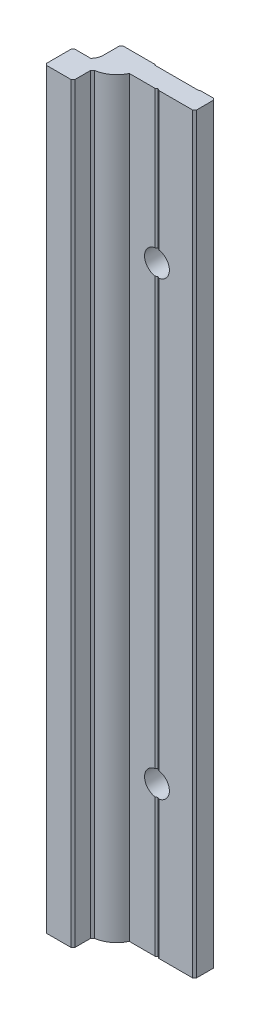
ISO-10303-21;
HEADER;
FILE_DESCRIPTION(('STEP AP214'),'2;1');
FILE_NAME('part.step','',(''),(''),'','','');
FILE_SCHEMA(('AUTOMOTIVE_DESIGN { 1 0 10303 214 1 1 1 1 }'));
ENDSEC;
DATA;
#1=APPLICATION_CONTEXT('core data for automotive mechanical design processes');
#2=APPLICATION_PROTOCOL_DEFINITION('international standard','automotive_design',2000,#1);
#3=PRODUCT_CONTEXT('',#1,'mechanical');
#4=PRODUCT('Part','Part','',(#3));
#5=PRODUCT_RELATED_PRODUCT_CATEGORY('part','',(#4));
#6=PRODUCT_DEFINITION_FORMATION('','',#4);
#7=PRODUCT_DEFINITION_CONTEXT('part definition',#1,'design');
#8=PRODUCT_DEFINITION('design','',#6,#7);
#9=PRODUCT_DEFINITION_SHAPE('','',#8);
#10=(LENGTH_UNIT() NAMED_UNIT(*) SI_UNIT(.MILLI.,.METRE.));
#11=(NAMED_UNIT(*) PLANE_ANGLE_UNIT() SI_UNIT($,.RADIAN.));
#12=(NAMED_UNIT(*) SI_UNIT($,.STERADIAN.) SOLID_ANGLE_UNIT());
#13=UNCERTAINTY_MEASURE_WITH_UNIT(LENGTH_MEASURE(1.E-05),#10,'distance_accuracy_value','');
#14=(GEOMETRIC_REPRESENTATION_CONTEXT(3) GLOBAL_UNCERTAINTY_ASSIGNED_CONTEXT((#13)) GLOBAL_UNIT_ASSIGNED_CONTEXT((#10,
#11,#12)) REPRESENTATION_CONTEXT('',''));
#15=CARTESIAN_POINT('',(0.,0.,0.));
#16=DIRECTION('',(0.,0.,1.));
#17=DIRECTION('',(1.,0.,0.));
#18=AXIS2_PLACEMENT_3D('',#15,#16,#17);
#19=CARTESIAN_POINT('',(-23.7,0.,14.65));
#20=DIRECTION('',(0.707106781186546,0.,0.707106781186549));
#21=DIRECTION('',(0.707106781186549,0.,-0.707106781186546));
#22=AXIS2_PLACEMENT_3D('',#19,#20,#21);
#23=PLANE('',#22);
#24=DIRECTION('',(0.707106781186549,0.,-0.707106781186546));
#25=VECTOR('',#24,1.);
#26=CARTESIAN_POINT('',(-23.45,0.,14.4));
#27=LINE('',#26,#25);
#28=CARTESIAN_POINT('',(-23.7,0.,14.65));
#29=VERTEX_POINT('',#28);
#30=CARTESIAN_POINT('',(-23.2,0.,14.15));
#31=VERTEX_POINT('',#30);
#32=EDGE_CURVE('E284',#29,#31,#27,.T.);
#33=ORIENTED_EDGE('',*,*,#32,.T.);
#34=DIRECTION('',(0.,-1.,0.));
#35=VECTOR('',#34,1.);
#36=CARTESIAN_POINT('',(-23.2,100.,14.15));
#37=LINE('',#36,#35);
#38=CARTESIAN_POINT('',(-23.2,200.,14.15));
#39=VERTEX_POINT('',#38);
#40=EDGE_CURVE('E229',#39,#31,#37,.T.);
#41=ORIENTED_EDGE('',*,*,#40,.F.);
#42=DIRECTION('',(-0.707106781186549,0.,0.707106781186546));
#43=VECTOR('',#42,1.);
#44=CARTESIAN_POINT('',(-23.45,200.,14.4));
#45=LINE('',#44,#43);
#46=CARTESIAN_POINT('',(-23.7,200.,14.65));
#47=VERTEX_POINT('',#46);
#48=EDGE_CURVE('E287',#39,#47,#45,.T.);
#49=ORIENTED_EDGE('',*,*,#48,.T.);
#50=DIRECTION('',(0.,1.,0.));
#51=VECTOR('',#50,1.);
#52=CARTESIAN_POINT('',(-23.7,100.,14.65));
#53=LINE('',#52,#51);
#54=EDGE_CURVE('E222',#29,#47,#53,.T.);
#55=ORIENTED_EDGE('',*,*,#54,.F.);
#56=EDGE_LOOP('',(#33,#41,#49,#55));
#57=FACE_BOUND('',#56,.T.);
#58=ADVANCED_FACE('F16',(#57),#23,.T.);
#59=CARTESIAN_POINT('',(-30.7,0.,14.15));
#60=DIRECTION('',(-0.707106781186546,0.,0.707106781186549));
#61=DIRECTION('',(0.707106781186549,0.,0.707106781186546));
#62=AXIS2_PLACEMENT_3D('',#59,#60,#61);
#63=PLANE('',#62);
#64=DIRECTION('',(0.707106781186549,0.,0.707106781186546));
#65=VECTOR('',#64,1.);
#66=CARTESIAN_POINT('',(-30.45,0.,14.4));
#67=LINE('',#66,#65);
#68=CARTESIAN_POINT('',(-30.7,0.,14.15));
#69=VERTEX_POINT('',#68);
#70=CARTESIAN_POINT('',(-30.2,0.,14.65));
#71=VERTEX_POINT('',#70);
#72=EDGE_CURVE('E276',#69,#71,#67,.T.);
#73=ORIENTED_EDGE('',*,*,#72,.T.);
#74=DIRECTION('',(0.,-1.,0.));
#75=VECTOR('',#74,1.);
#76=CARTESIAN_POINT('',(-30.2,100.,14.65));
#77=LINE('',#76,#75);
#78=CARTESIAN_POINT('',(-30.2,200.,14.65));
#79=VERTEX_POINT('',#78);
#80=EDGE_CURVE('E225',#79,#71,#77,.T.);
#81=ORIENTED_EDGE('',*,*,#80,.F.);
#82=DIRECTION('',(-0.707106781186549,0.,-0.707106781186546));
#83=VECTOR('',#82,1.);
#84=CARTESIAN_POINT('',(-30.45,200.,14.4));
#85=LINE('',#84,#83);
#86=CARTESIAN_POINT('',(-30.7,200.,14.15));
#87=VERTEX_POINT('',#86);
#88=EDGE_CURVE('E281',#79,#87,#85,.T.);
#89=ORIENTED_EDGE('',*,*,#88,.T.);
#90=DIRECTION('',(0.,1.,0.));
#91=VECTOR('',#90,1.);
#92=CARTESIAN_POINT('',(-30.7,100.,14.15));
#93=LINE('',#92,#91);
#94=EDGE_CURVE('E216',#69,#87,#93,.T.);
#95=ORIENTED_EDGE('',*,*,#94,.F.);
#96=EDGE_LOOP('',(#73,#81,#89,#95));
#97=FACE_BOUND('',#96,.T.);
#98=ADVANCED_FACE('F590',(#97),#63,.T.);
#99=CARTESIAN_POINT('',(-30.2,0.,7.15));
#100=DIRECTION('',(-0.707106781186547,0.,-0.707106781186547));
#101=DIRECTION('',(-0.707106781186547,0.,0.707106781186547));
#102=AXIS2_PLACEMENT_3D('',#99,#100,#101);
#103=PLANE('',#102);
#104=DIRECTION('',(-0.707106781186547,0.,0.707106781186547));
#105=VECTOR('',#104,1.);
#106=CARTESIAN_POINT('',(-30.45,0.,7.4));
#107=LINE('',#106,#105);
#108=CARTESIAN_POINT('',(-30.2,0.,7.15));
#109=VERTEX_POINT('',#108);
#110=CARTESIAN_POINT('',(-30.7,0.,7.65));
#111=VERTEX_POINT('',#110);
#112=EDGE_CURVE('E270',#109,#111,#107,.T.);
#113=ORIENTED_EDGE('',*,*,#112,.T.);
#114=DIRECTION('',(0.,-1.,0.));
#115=VECTOR('',#114,1.);
#116=CARTESIAN_POINT('',(-30.7,100.,7.65));
#117=LINE('',#116,#115);
#118=CARTESIAN_POINT('',(-30.7,200.,7.65));
#119=VERTEX_POINT('',#118);
#120=EDGE_CURVE('E221',#119,#111,#117,.T.);
#121=ORIENTED_EDGE('',*,*,#120,.F.);
#122=DIRECTION('',(0.707106781186547,0.,-0.707106781186547));
#123=VECTOR('',#122,1.);
#124=CARTESIAN_POINT('',(-30.45,200.,7.4));
#125=LINE('',#124,#123);
#126=CARTESIAN_POINT('',(-30.2,200.,7.15));
#127=VERTEX_POINT('',#126);
#128=EDGE_CURVE('E272',#119,#127,#125,.T.);
#129=ORIENTED_EDGE('',*,*,#128,.T.);
#130=DIRECTION('',(0.,1.,0.));
#131=VECTOR('',#130,1.);
#132=CARTESIAN_POINT('',(-30.2,100.,7.15));
#133=LINE('',#132,#131);
#134=EDGE_CURVE('E213',#109,#127,#133,.T.);
#135=ORIENTED_EDGE('',*,*,#134,.F.);
#136=EDGE_LOOP('',(#113,#121,#129,#135));
#137=FACE_BOUND('',#136,.T.);
#138=ADVANCED_FACE('F599',(#137),#103,.T.);
#139=CARTESIAN_POINT('',(0.,0.,0.5));
#140=DIRECTION('',(0.707106781186547,0.,-0.707106781186547));
#141=DIRECTION('',(-0.707106781186547,0.,-0.707106781186547));
#142=AXIS2_PLACEMENT_3D('',#139,#140,#141);
#143=PLANE('',#142);
#144=DIRECTION('',(-0.707106781186548,0.,-0.707106781186548));
#145=VECTOR('',#144,1.);
#146=CARTESIAN_POINT('',(-0.25,0.,0.25));
#147=LINE('',#146,#145);
#148=CARTESIAN_POINT('',(0.,0.,0.5));
#149=VERTEX_POINT('',#148);
#150=CARTESIAN_POINT('',(-0.5,0.,0.));
#151=VERTEX_POINT('',#150);
#152=EDGE_CURVE('E263',#149,#151,#147,.T.);
#153=ORIENTED_EDGE('',*,*,#152,.T.);
#154=DIRECTION('',(0.,-1.,0.));
#155=VECTOR('',#154,1.);
#156=CARTESIAN_POINT('',(-0.5,100.,0.));
#157=LINE('',#156,#155);
#158=CARTESIAN_POINT('',(-0.5,200.,0.));
#159=VERTEX_POINT('',#158);
#160=EDGE_CURVE('E205',#159,#151,#157,.T.);
#161=ORIENTED_EDGE('',*,*,#160,.F.);
#162=DIRECTION('',(0.707106781186548,0.,0.707106781186548));
#163=VECTOR('',#162,1.);
#164=CARTESIAN_POINT('',(-0.25,200.,0.25));
#165=LINE('',#164,#163);
#166=CARTESIAN_POINT('',(0.,200.,0.5));
#167=VERTEX_POINT('',#166);
#168=EDGE_CURVE('E69',#159,#167,#165,.T.);
#169=ORIENTED_EDGE('',*,*,#168,.T.);
#170=DIRECTION('',(0.,1.,0.));
#171=VECTOR('',#170,1.);
#172=CARTESIAN_POINT('',(0.,100.,0.5));
#173=LINE('',#172,#171);
#174=EDGE_CURVE('E232',#149,#167,#173,.T.);
#175=ORIENTED_EDGE('',*,*,#174,.F.);
#176=EDGE_LOOP('',(#153,#161,#169,#175));
#177=FACE_BOUND('',#176,.T.);
#178=ADVANCED_FACE('F552',(#177),#143,.T.);
#179=CARTESIAN_POINT('',(-24.5,0.,0.));
#180=DIRECTION('',(-0.707106781186547,0.,-0.707106781186548));
#181=DIRECTION('',(-0.707106781186548,0.,0.707106781186547));
#182=AXIS2_PLACEMENT_3D('',#179,#180,#181);
#183=PLANE('',#182);
#184=DIRECTION('',(-0.707106781186548,0.,0.707106781186547));
#185=VECTOR('',#184,1.);
#186=CARTESIAN_POINT('',(-24.75,0.,0.25));
#187=LINE('',#186,#185);
#188=CARTESIAN_POINT('',(-24.5,0.,0.));
#189=VERTEX_POINT('',#188);
#190=CARTESIAN_POINT('',(-25.0000000003449,0.,0.5));
#191=VERTEX_POINT('',#190);
#192=EDGE_CURVE('E254',#189,#191,#187,.T.);
#193=ORIENTED_EDGE('',*,*,#192,.T.);
#194=DIRECTION('',(0.,-1.,0.));
#195=VECTOR('',#194,1.);
#196=CARTESIAN_POINT('',(-25.0000000010348,100.,0.5));
#197=LINE('',#196,#195);
#198=CARTESIAN_POINT('',(-25.0000000003449,200.,0.5));
#199=VERTEX_POINT('',#198);
#200=EDGE_CURVE('E206',#199,#191,#197,.T.);
#201=ORIENTED_EDGE('',*,*,#200,.F.);
#202=DIRECTION('',(0.707106781186548,0.,-0.707106781186547));
#203=VECTOR('',#202,1.);
#204=CARTESIAN_POINT('',(-24.75,200.,0.25));
#205=LINE('',#204,#203);
#206=CARTESIAN_POINT('',(-24.5,200.,0.));
#207=VERTEX_POINT('',#206);
#208=EDGE_CURVE('E260',#199,#207,#205,.T.);
#209=ORIENTED_EDGE('',*,*,#208,.T.);
#210=DIRECTION('',(0.,1.,0.));
#211=VECTOR('',#210,1.);
#212=CARTESIAN_POINT('',(-24.5,100.,0.));
#213=LINE('',#212,#211);
#214=EDGE_CURVE('E315',#189,#207,#213,.T.);
#215=ORIENTED_EDGE('',*,*,#214,.F.);
#216=EDGE_LOOP('',(#193,#201,#209,#215));
#217=FACE_BOUND('',#216,.T.);
#218=ADVANCED_FACE('F614',(#217),#183,.T.);
#219=CARTESIAN_POINT('',(-23.1999999999615,0.,9.95000000003852));
#220=DIRECTION('',(0.707106781186546,0.,0.707106781186549));
#221=DIRECTION('',(0.707106781186549,0.,-0.707106781186546));
#222=AXIS2_PLACEMENT_3D('',#219,#220,#221);
#223=PLANE('',#222);
#224=DIRECTION('',(0.707106781186549,0.,-0.707106781186546));
#225=VECTOR('',#224,1.);
#226=CARTESIAN_POINT('',(-22.9499999999663,0.,9.70000000004329));
#227=LINE('',#226,#225);
#228=CARTESIAN_POINT('',(-23.1999999999615,0.,9.95000000003852));
#229=VERTEX_POINT('',#228);
#230=CARTESIAN_POINT('',(-22.6999999999902,0.,9.4500000000672));
#231=VERTEX_POINT('',#230);
#232=EDGE_CURVE('E244',#229,#231,#227,.T.);
#233=ORIENTED_EDGE('',*,*,#232,.T.);
#234=DIRECTION('',(0.,-1.,0.));
#235=VECTOR('',#234,1.);
#236=CARTESIAN_POINT('',(-22.6999999999903,100.,9.45000000006733));
#237=LINE('',#236,#235);
#238=CARTESIAN_POINT('',(-22.6999999999903,200.,9.45000000006733));
#239=VERTEX_POINT('',#238);
#240=EDGE_CURVE('E422',#239,#231,#237,.T.);
#241=ORIENTED_EDGE('',*,*,#240,.F.);
#242=DIRECTION('',(-0.707106781186556,0.,0.707106781186539));
#243=VECTOR('',#242,1.);
#244=CARTESIAN_POINT('',(-22.9499999999662,200.,9.70000000004329));
#245=LINE('',#244,#243);
#246=CARTESIAN_POINT('',(-23.1999999999807,200.,9.95000000001926));
#247=VERTEX_POINT('',#246);
#248=EDGE_CURVE('E251',#239,#247,#245,.T.);
#249=ORIENTED_EDGE('',*,*,#248,.T.);
#250=DIRECTION('',(0.,1.,0.));
#251=VECTOR('',#250,1.);
#252=CARTESIAN_POINT('',(-23.2,100.,9.95));
#253=LINE('',#252,#251);
#254=EDGE_CURVE('E228',#229,#247,#253,.T.);
#255=ORIENTED_EDGE('',*,*,#254,.F.);
#256=EDGE_LOOP('',(#233,#241,#249,#255));
#257=FACE_BOUND('',#256,.T.);
#258=ADVANCED_FACE('F576',(#257),#223,.T.);
#259=CARTESIAN_POINT('',(0.,0.,5.));
#260=DIRECTION('',(1.,0.,0.));
#261=DIRECTION('',(0.,0.,-1.));
#262=AXIS2_PLACEMENT_3D('',#259,#260,#261);
#263=PLANE('',#262);
#264=DIRECTION('',(0.,0.,1.));
#265=VECTOR('',#264,1.);
#266=CARTESIAN_POINT('',(0.,0.,7.325));
#267=LINE('',#266,#265);
#268=CARTESIAN_POINT('',(0.,0.,5.));
#269=VERTEX_POINT('',#268);
#270=EDGE_CURVE('E236',#149,#269,#267,.T.);
#271=ORIENTED_EDGE('',*,*,#270,.F.);
#272=ORIENTED_EDGE('',*,*,#174,.T.);
#273=DIRECTION('',(0.,0.,-1.));
#274=VECTOR('',#273,1.);
#275=CARTESIAN_POINT('',(0.,200.,7.325));
#276=LINE('',#275,#274);
#277=CARTESIAN_POINT('',(0.,200.,5.));
#278=VERTEX_POINT('',#277);
#279=EDGE_CURVE('E180',#278,#167,#276,.T.);
#280=ORIENTED_EDGE('',*,*,#279,.F.);
#281=DIRECTION('',(0.,1.,0.));
#282=VECTOR('',#281,1.);
#283=CARTESIAN_POINT('',(0.,99.9999999999999,5.));
#284=LINE('',#283,#282);
#285=EDGE_CURVE('E60',#269,#278,#284,.T.);
#286=ORIENTED_EDGE('',*,*,#285,.F.);
#287=EDGE_LOOP('',(#271,#272,#280,#286));
#288=FACE_BOUND('',#287,.T.);
#289=ADVANCED_FACE('F564',(#288),#263,.T.);
#290=CARTESIAN_POINT('',(-23.2,0.,14.15));
#291=DIRECTION('',(1.,0.,0.));
#292=DIRECTION('',(0.,0.,-1.));
#293=AXIS2_PLACEMENT_3D('',#290,#291,#292);
#294=PLANE('',#293);
#295=DIRECTION('',(0.,0.,1.));
#296=VECTOR('',#295,1.);
#297=CARTESIAN_POINT('',(-23.2,0.,7.325));
#298=LINE('',#297,#296);
#299=EDGE_CURVE('E301',#229,#31,#298,.T.);
#300=ORIENTED_EDGE('',*,*,#299,.F.);
#301=ORIENTED_EDGE('',*,*,#254,.T.);
#302=DIRECTION('',(0.,0.,-1.));
#303=VECTOR('',#302,1.);
#304=CARTESIAN_POINT('',(-23.2,200.,7.325));
#305=LINE('',#304,#303);
#306=EDGE_CURVE('E308',#39,#247,#305,.T.);
#307=ORIENTED_EDGE('',*,*,#306,.F.);
#308=ORIENTED_EDGE('',*,*,#40,.T.);
#309=EDGE_LOOP('',(#300,#301,#307,#308));
#310=FACE_BOUND('',#309,.T.);
#311=ADVANCED_FACE('F579',(#310),#294,.T.);
#312=CARTESIAN_POINT('',(-30.2,0.,14.65));
#313=DIRECTION('',(0.,0.,1.));
#314=DIRECTION('',(1.,0.,0.));
#315=AXIS2_PLACEMENT_3D('',#312,#313,#314);
#316=PLANE('',#315);
#317=DIRECTION('',(-1.,0.,0.));
#318=VECTOR('',#317,1.);
#319=CARTESIAN_POINT('',(-15.35,0.,14.65));
#320=LINE('',#319,#318);
#321=EDGE_CURVE('E304',#29,#71,#320,.T.);
#322=ORIENTED_EDGE('',*,*,#321,.F.);
#323=ORIENTED_EDGE('',*,*,#54,.T.);
#324=DIRECTION('',(1.,0.,0.));
#325=VECTOR('',#324,1.);
#326=CARTESIAN_POINT('',(-15.35,200.,14.65));
#327=LINE('',#326,#325);
#328=EDGE_CURVE('E312',#79,#47,#327,.T.);
#329=ORIENTED_EDGE('',*,*,#328,.F.);
#330=ORIENTED_EDGE('',*,*,#80,.T.);
#331=EDGE_LOOP('',(#322,#323,#329,#330));
#332=FACE_BOUND('',#331,.T.);
#333=ADVANCED_FACE('F586',(#332),#316,.T.);
#334=CARTESIAN_POINT('',(-30.7,0.,7.65));
#335=DIRECTION('',(-1.,0.,0.));
#336=DIRECTION('',(0.,0.,1.));
#337=AXIS2_PLACEMENT_3D('',#334,#335,#336);
#338=PLANE('',#337);
#339=DIRECTION('',(0.,0.,-1.));
#340=VECTOR('',#339,1.);
#341=CARTESIAN_POINT('',(-30.7,0.,7.325));
#342=LINE('',#341,#340);
#343=EDGE_CURVE('E351',#69,#111,#342,.T.);
#344=ORIENTED_EDGE('',*,*,#343,.F.);
#345=ORIENTED_EDGE('',*,*,#94,.T.);
#346=DIRECTION('',(0.,0.,1.));
#347=VECTOR('',#346,1.);
#348=CARTESIAN_POINT('',(-30.7,200.,7.325));
#349=LINE('',#348,#347);
#350=EDGE_CURVE('E357',#119,#87,#349,.T.);
#351=ORIENTED_EDGE('',*,*,#350,.F.);
#352=ORIENTED_EDGE('',*,*,#120,.T.);
#353=EDGE_LOOP('',(#344,#345,#351,#352));
#354=FACE_BOUND('',#353,.T.);
#355=ADVANCED_FACE('F594',(#354),#338,.T.);
#356=CARTESIAN_POINT('',(-26.,0.,7.15));
#357=DIRECTION('',(0.,0.,-1.));
#358=DIRECTION('',(-1.,0.,0.));
#359=AXIS2_PLACEMENT_3D('',#356,#357,#358);
#360=PLANE('',#359);
#361=DIRECTION('',(1.,0.,0.));
#362=VECTOR('',#361,1.);
#363=CARTESIAN_POINT('',(-15.35,0.,7.15));
#364=LINE('',#363,#362);
#365=CARTESIAN_POINT('',(-26.,0.,7.15));
#366=VERTEX_POINT('',#365);
#367=EDGE_CURVE('E354',#109,#366,#364,.T.);
#368=ORIENTED_EDGE('',*,*,#367,.F.);
#369=ORIENTED_EDGE('',*,*,#134,.T.);
#370=DIRECTION('',(-1.,0.,0.));
#371=VECTOR('',#370,1.);
#372=CARTESIAN_POINT('',(-15.35,200.,7.15));
#373=LINE('',#372,#371);
#374=CARTESIAN_POINT('',(-26.,200.,7.15));
#375=VERTEX_POINT('',#374);
#376=EDGE_CURVE('E360',#375,#127,#373,.T.);
#377=ORIENTED_EDGE('',*,*,#376,.F.);
#378=DIRECTION('',(0.,1.,0.));
#379=VECTOR('',#378,1.);
#380=CARTESIAN_POINT('',(-26.,100.,7.15));
#381=LINE('',#380,#379);
#382=EDGE_CURVE('E209',#366,#375,#381,.T.);
#383=ORIENTED_EDGE('',*,*,#382,.F.);
#384=EDGE_LOOP('',(#368,#369,#377,#383));
#385=FACE_BOUND('',#384,.T.);
#386=ADVANCED_FACE('F602',(#385),#360,.T.);
#387=CARTESIAN_POINT('',(-28.0265721799999,0.,4.90207378000002));
#388=DIRECTION('',(0.,1.,0.));
#389=DIRECTION('',(0.,0.,1.));
#390=AXIS2_PLACEMENT_3D('',#387,#388,#389);
#391=CYLINDRICAL_SURFACE('',#390,3.02657679422034);
#392=CARTESIAN_POINT('',(-28.0265721799999,0.,4.90207378000002));
#393=DIRECTION('',(0.,1.,0.));
#394=DIRECTION('',(0.,0.,1.));
#395=AXIS2_PLACEMENT_3D('',#392,#393,#394);
#396=CIRCLE('',#395,3.02657679422034);
#397=CARTESIAN_POINT('',(-25.0000000005174,0.,4.90735930999819));
#398=VERTEX_POINT('',#397);
#399=EDGE_CURVE('E400',#366,#398,#396,.T.);
#400=ORIENTED_EDGE('',*,*,#399,.F.);
#401=ORIENTED_EDGE('',*,*,#382,.T.);
#402=CARTESIAN_POINT('',(-28.0265721799999,200.,4.90207378000002));
#403=DIRECTION('',(0.,1.,0.));
#404=DIRECTION('',(0.,0.,1.));
#405=AXIS2_PLACEMENT_3D('',#402,#403,#404);
#406=CIRCLE('',#405,3.02657679422034);
#407=CARTESIAN_POINT('',(-25.0000000007761,200.,4.90735930999819));
#408=VERTEX_POINT('',#407);
#409=EDGE_CURVE('E415',#408,#375,#406,.F.);
#410=ORIENTED_EDGE('',*,*,#409,.F.);
#411=DIRECTION('',(0.,1.,0.));
#412=VECTOR('',#411,1.);
#413=CARTESIAN_POINT('',(-25.0000000010348,100.,4.90735930999819));
#414=LINE('',#413,#412);
#415=EDGE_CURVE('E203',#398,#408,#414,.T.);
#416=ORIENTED_EDGE('',*,*,#415,.F.);
#417=EDGE_LOOP('',(#400,#401,#410,#416));
#418=FACE_BOUND('',#417,.T.);
#419=ADVANCED_FACE('F606',(#418),#391,.F.);
#420=CARTESIAN_POINT('',(-25.0000000010348,0.,0.5));
#421=DIRECTION('',(-1.,0.,0.));
#422=DIRECTION('',(0.,0.,1.));
#423=AXIS2_PLACEMENT_3D('',#420,#421,#422);
#424=PLANE('',#423);
#425=DIRECTION('',(0.,0.,-1.));
#426=VECTOR('',#425,1.);
#427=CARTESIAN_POINT('',(-25.,0.,7.325));
#428=LINE('',#427,#426);
#429=EDGE_CURVE('E324',#398,#191,#428,.T.);
#430=ORIENTED_EDGE('',*,*,#429,.F.);
#431=ORIENTED_EDGE('',*,*,#415,.T.);
#432=DIRECTION('',(0.,0.,1.));
#433=VECTOR('',#432,1.);
#434=CARTESIAN_POINT('',(-25.,200.,7.325));
#435=LINE('',#434,#433);
#436=EDGE_CURVE('E330',#199,#408,#435,.T.);
#437=ORIENTED_EDGE('',*,*,#436,.F.);
#438=ORIENTED_EDGE('',*,*,#200,.T.);
#439=EDGE_LOOP('',(#430,#431,#437,#438));
#440=FACE_BOUND('',#439,.T.);
#441=ADVANCED_FACE('F610',(#440),#424,.T.);
#442=CARTESIAN_POINT('',(-0.5,0.,0.));
#443=DIRECTION('',(0.,0.,-1.));
#444=DIRECTION('',(-1.,0.,0.));
#445=AXIS2_PLACEMENT_3D('',#442,#443,#444);
#446=PLANE('',#445);
#447=DIRECTION('',(1.,0.,0.));
#448=VECTOR('',#447,1.);
#449=CARTESIAN_POINT('',(-15.35,0.,0.));
#450=LINE('',#449,#448);
#451=CARTESIAN_POINT('',(-4.,0.,0.));
#452=VERTEX_POINT('',#451);
#453=EDGE_CURVE('E337',#452,#151,#450,.T.);
#454=ORIENTED_EDGE('',*,*,#453,.F.);
#455=DIRECTION('',(0.,-1.,0.));
#456=VECTOR('',#455,1.);
#457=CARTESIAN_POINT('',(-4.,100.,0.));
#458=LINE('',#457,#456);
#459=CARTESIAN_POINT('',(-4.,200.,0.));
#460=VERTEX_POINT('',#459);
#461=EDGE_CURVE('E240',#460,#452,#458,.T.);
#462=ORIENTED_EDGE('',*,*,#461,.F.);
#463=DIRECTION('',(-1.,0.,0.));
#464=VECTOR('',#463,1.);
#465=CARTESIAN_POINT('',(-15.35,200.,0.));
#466=LINE('',#465,#464);
#467=EDGE_CURVE('E248',#159,#460,#466,.T.);
#468=ORIENTED_EDGE('',*,*,#467,.F.);
#469=ORIENTED_EDGE('',*,*,#160,.T.);
#470=EDGE_LOOP('',(#454,#462,#468,#469));
#471=FACE_BOUND('',#470,.T.);
#472=ADVANCED_FACE('F557',(#471),#446,.T.);
#473=CARTESIAN_POINT('',(-16.,0.,0.));
#474=DIRECTION('',(0.,0.,-1.));
#475=DIRECTION('',(-1.,0.,0.));
#476=AXIS2_PLACEMENT_3D('',#473,#474,#475);
#477=PLANE('',#476);
#478=DIRECTION('',(1.,0.,0.));
#479=VECTOR('',#478,1.);
#480=CARTESIAN_POINT('',(-15.35,0.,0.));
#481=LINE('',#480,#479);
#482=CARTESIAN_POINT('',(-16.,0.,0.));
#483=VERTEX_POINT('',#482);
#484=EDGE_CURVE('E320',#189,#483,#481,.T.);
#485=ORIENTED_EDGE('',*,*,#484,.F.);
#486=ORIENTED_EDGE('',*,*,#214,.T.);
#487=DIRECTION('',(-1.,0.,0.));
#488=VECTOR('',#487,1.);
#489=CARTESIAN_POINT('',(-15.35,200.,0.));
#490=LINE('',#489,#488);
#491=CARTESIAN_POINT('',(-16.,200.,0.));
#492=VERTEX_POINT('',#491);
#493=EDGE_CURVE('E327',#492,#207,#490,.T.);
#494=ORIENTED_EDGE('',*,*,#493,.F.);
#495=DIRECTION('',(0.,1.,0.));
#496=VECTOR('',#495,1.);
#497=CARTESIAN_POINT('',(-16.,100.,0.));
#498=LINE('',#497,#496);
#499=EDGE_CURVE('E397',#483,#492,#498,.T.);
#500=ORIENTED_EDGE('',*,*,#499,.F.);
#501=EDGE_LOOP('',(#485,#486,#494,#500));
#502=FACE_BOUND('',#501,.T.);
#503=ADVANCED_FACE('F618',(#502),#477,.T.);
#504=CARTESIAN_POINT('',(-10.,43.26190128606,5.21132487));
#505=DIRECTION('',(-0.499999994031162,0.,0.866025407230549));
#506=DIRECTION('',(0.866025407230549,0.,0.499999994031162));
#507=AXIS2_PLACEMENT_3D('',#504,#505,#506);
#508=PLANE('',#507);
#509=CARTESIAN_POINT('',(-10.,40.,5.21132487));
#510=DIRECTION('',(-0.499999994031162,0.,0.866025407230549));
#511=DIRECTION('',(0.866025407230549,0.,0.499999994031162));
#512=AXIS2_PLACEMENT_3D('',#509,#510,#511);
#513=ELLIPSE('',#512,3.81051176148864,3.3);
#514=CARTESIAN_POINT('',(-10.,43.3,5.21132487));
#515=VERTEX_POINT('',#514);
#516=CARTESIAN_POINT('',(-9.5,43.26190128606,5.5));
#517=VERTEX_POINT('',#516);
#518=EDGE_CURVE('E20',#515,#517,#513,.F.);
#519=ORIENTED_EDGE('',*,*,#518,.T.);
#520=DIRECTION('',(0.,-1.,0.));
#521=VECTOR('',#520,1.);
#522=CARTESIAN_POINT('',(-9.5,100.,5.5));
#523=LINE('',#522,#521);
#524=CARTESIAN_POINT('',(-9.5,156.73809871394,5.5));
#525=VERTEX_POINT('',#524);
#526=EDGE_CURVE('E386',#525,#517,#523,.T.);
#527=ORIENTED_EDGE('',*,*,#526,.F.);
#528=CARTESIAN_POINT('',(-10.,160.,5.21132487));
#529=DIRECTION('',(-0.499999994031162,0.,0.866025407230549));
#530=DIRECTION('',(0.866025407230549,0.,0.499999994031162));
#531=AXIS2_PLACEMENT_3D('',#528,#529,#530);
#532=ELLIPSE('',#531,3.81051176148866,3.30000000000001);
#533=CARTESIAN_POINT('',(-10.,156.7,5.21132487));
#534=VERTEX_POINT('',#533);
#535=EDGE_CURVE('E392',#534,#525,#532,.T.);
#536=ORIENTED_EDGE('',*,*,#535,.F.);
#537=DIRECTION('',(0.,1.,0.));
#538=VECTOR('',#537,1.);
#539=CARTESIAN_POINT('',(-10.,100.,5.21132487));
#540=LINE('',#539,#538);
#541=EDGE_CURVE('E181',#515,#534,#540,.T.);
#542=ORIENTED_EDGE('',*,*,#541,.F.);
#543=EDGE_LOOP('',(#519,#527,#536,#542));
#544=FACE_BOUND('',#543,.T.);
#545=ADVANCED_FACE('F431',(#544),#508,.T.);
#546=CARTESIAN_POINT('',(-10.,0.,5.21132487));
#547=DIRECTION('',(-0.499999994031162,0.,0.866025407230549));
#548=DIRECTION('',(0.866025407230549,0.,0.499999994031162));
#549=AXIS2_PLACEMENT_3D('',#546,#547,#548);
#550=PLANE('',#549);
#551=DIRECTION('',(-0.866025407230548,0.,-0.499999994031164));
#552=VECTOR('',#551,1.);
#553=CARTESIAN_POINT('',(-9.5,0.,5.5));
#554=LINE('',#553,#552);
#555=CARTESIAN_POINT('',(-9.5,0.,5.5));
#556=VERTEX_POINT('',#555);
#557=CARTESIAN_POINT('',(-10.,0.,5.21132487));
#558=VERTEX_POINT('',#557);
#559=EDGE_CURVE('E407',#556,#558,#554,.T.);
#560=ORIENTED_EDGE('',*,*,#559,.F.);
#561=DIRECTION('',(0.,-1.,0.));
#562=VECTOR('',#561,1.);
#563=CARTESIAN_POINT('',(-9.5,100.,5.5));
#564=LINE('',#563,#562);
#565=CARTESIAN_POINT('',(-9.5,36.73809871394,5.5));
#566=VERTEX_POINT('',#565);
#567=EDGE_CURVE('E199',#566,#556,#564,.T.);
#568=ORIENTED_EDGE('',*,*,#567,.F.);
#569=CARTESIAN_POINT('',(-10.,40.,5.21132487));
#570=DIRECTION('',(-0.499999994031162,0.,0.866025407230549));
#571=DIRECTION('',(0.866025407230549,0.,0.499999994031162));
#572=AXIS2_PLACEMENT_3D('',#569,#570,#571);
#573=ELLIPSE('',#572,3.81051176148864,3.3);
#574=CARTESIAN_POINT('',(-10.,36.7,5.21132487));
#575=VERTEX_POINT('',#574);
#576=EDGE_CURVE('E235',#566,#575,#573,.F.);
#577=ORIENTED_EDGE('',*,*,#576,.T.);
#578=DIRECTION('',(0.,1.,0.));
#579=VECTOR('',#578,1.);
#580=CARTESIAN_POINT('',(-10.,18.36904935697,5.21132487));
#581=LINE('',#580,#579);
#582=EDGE_CURVE('E419',#558,#575,#581,.T.);
#583=ORIENTED_EDGE('',*,*,#582,.F.);
#584=EDGE_LOOP('',(#560,#568,#577,#583));
#585=FACE_BOUND('',#584,.T.);
#586=ADVANCED_FACE('F435',(#585),#550,.T.);
#587=CARTESIAN_POINT('',(-0.5,0.,5.5));
#588=DIRECTION('',(0.707106781186547,0.,0.707106781186548));
#589=DIRECTION('',(0.707106781186548,0.,-0.707106781186547));
#590=AXIS2_PLACEMENT_3D('',#587,#588,#589);
#591=PLANE('',#590);
#592=DIRECTION('',(-0.707106781186547,0.,0.707106781186547));
#593=VECTOR('',#592,1.);
#594=CARTESIAN_POINT('',(0.,0.,5.));
#595=LINE('',#594,#593);
#596=CARTESIAN_POINT('',(-0.5,0.,5.5));
#597=VERTEX_POINT('',#596);
#598=EDGE_CURVE('E239',#269,#597,#595,.T.);
#599=ORIENTED_EDGE('',*,*,#598,.F.);
#600=ORIENTED_EDGE('',*,*,#285,.T.);
#601=DIRECTION('',(0.707106781186547,0.,-0.707106781186548));
#602=VECTOR('',#601,1.);
#603=CARTESIAN_POINT('',(-0.5,200.,5.5));
#604=LINE('',#603,#602);
#605=CARTESIAN_POINT('',(-0.5,200.,5.5));
#606=VERTEX_POINT('',#605);
#607=EDGE_CURVE('E172',#606,#278,#604,.T.);
#608=ORIENTED_EDGE('',*,*,#607,.F.);
#609=DIRECTION('',(0.,1.,0.));
#610=VECTOR('',#609,1.);
#611=CARTESIAN_POINT('',(-0.5,100.,5.5));
#612=LINE('',#611,#610);
#613=EDGE_CURVE('E176',#597,#606,#612,.T.);
#614=ORIENTED_EDGE('',*,*,#613,.F.);
#615=EDGE_LOOP('',(#599,#600,#608,#614));
#616=FACE_BOUND('',#615,.T.);
#617=ADVANCED_FACE('F174',(#616),#591,.T.);
#618=CARTESIAN_POINT('',(-10.,163.26190128606,5.21132487));
#619=DIRECTION('',(-0.499999994031162,0.,0.866025407230549));
#620=DIRECTION('',(0.866025407230549,0.,0.499999994031162));
#621=AXIS2_PLACEMENT_3D('',#618,#619,#620);
#622=PLANE('',#621);
#623=DIRECTION('',(0.866025407230548,0.,0.499999994031164));
#624=VECTOR('',#623,1.);
#625=CARTESIAN_POINT('',(-10.,200.,5.21132487));
#626=LINE('',#625,#624);
#627=CARTESIAN_POINT('',(-10.,200.,5.21132487));
#628=VERTEX_POINT('',#627);
#629=CARTESIAN_POINT('',(-9.5,200.,5.5));
#630=VERTEX_POINT('',#629);
#631=EDGE_CURVE('E188',#628,#630,#626,.T.);
#632=ORIENTED_EDGE('',*,*,#631,.F.);
#633=DIRECTION('',(0.,1.,0.));
#634=VECTOR('',#633,1.);
#635=CARTESIAN_POINT('',(-10.,181.63095064303,5.21132487));
#636=LINE('',#635,#634);
#637=CARTESIAN_POINT('',(-10.,163.3,5.21132487));
#638=VERTEX_POINT('',#637);
#639=EDGE_CURVE('E234',#638,#628,#636,.T.);
#640=ORIENTED_EDGE('',*,*,#639,.F.);
#641=CARTESIAN_POINT('',(-10.,160.,5.21132487));
#642=DIRECTION('',(-0.499999994031162,0.,0.866025407230549));
#643=DIRECTION('',(0.866025407230549,0.,0.499999994031162));
#644=AXIS2_PLACEMENT_3D('',#641,#642,#643);
#645=ELLIPSE('',#644,3.81051176148866,3.30000000000001);
#646=CARTESIAN_POINT('',(-9.5,163.26190128606,5.5));
#647=VERTEX_POINT('',#646);
#648=EDGE_CURVE('E389',#647,#638,#645,.T.);
#649=ORIENTED_EDGE('',*,*,#648,.F.);
#650=DIRECTION('',(0.,-1.,0.));
#651=VECTOR('',#650,1.);
#652=CARTESIAN_POINT('',(-9.5,100.,5.5));
#653=LINE('',#652,#651);
#654=EDGE_CURVE('E192',#630,#647,#653,.T.);
#655=ORIENTED_EDGE('',*,*,#654,.F.);
#656=EDGE_LOOP('',(#632,#640,#649,#655));
#657=FACE_BOUND('',#656,.T.);
#658=ADVANCED_FACE('F489',(#657),#622,.T.);
#659=CARTESIAN_POINT('',(-10.5,163.26190128606,5.5));
#660=DIRECTION('',(0.499999994031162,0.,0.866025407230549));
#661=DIRECTION('',(0.866025407230549,0.,-0.499999994031162));
#662=AXIS2_PLACEMENT_3D('',#659,#660,#661);
#663=PLANE('',#662);
#664=DIRECTION('',(0.866025407230547,0.,-0.499999994031165));
#665=VECTOR('',#664,1.);
#666=CARTESIAN_POINT('',(-10.5,200.,5.5));
#667=LINE('',#666,#665);
#668=CARTESIAN_POINT('',(-10.5,200.,5.5));
#669=VERTEX_POINT('',#668);
#670=EDGE_CURVE('E412',#669,#628,#667,.T.);
#671=ORIENTED_EDGE('',*,*,#670,.F.);
#672=DIRECTION('',(0.,1.,0.));
#673=VECTOR('',#672,1.);
#674=CARTESIAN_POINT('',(-10.5,100.,5.5));
#675=LINE('',#674,#673);
#676=CARTESIAN_POINT('',(-10.5,163.26190128606,5.5));
#677=VERTEX_POINT('',#676);
#678=EDGE_CURVE('E382',#677,#669,#675,.T.);
#679=ORIENTED_EDGE('',*,*,#678,.F.);
#680=CARTESIAN_POINT('',(-10.,160.,5.21132487));
#681=DIRECTION('',(0.499999994031162,0.,0.866025407230549));
#682=DIRECTION('',(-0.866025407230549,0.,0.499999994031162));
#683=AXIS2_PLACEMENT_3D('',#680,#681,#682);
#684=ELLIPSE('',#683,3.81051176148866,3.30000000000001);
#685=EDGE_CURVE('E387',#638,#677,#684,.T.);
#686=ORIENTED_EDGE('',*,*,#685,.F.);
#687=ORIENTED_EDGE('',*,*,#639,.T.);
#688=EDGE_LOOP('',(#671,#679,#686,#687));
#689=FACE_BOUND('',#688,.T.);
#690=ADVANCED_FACE('F484',(#689),#663,.T.);
#691=CARTESIAN_POINT('',(-23.7,200.,2.52179677000003));
#692=DIRECTION('',(0.,-1.,0.));
#693=DIRECTION('',(1.,0.,0.));
#694=AXIS2_PLACEMENT_3D('',#691,#692,#693);
#695=CYLINDRICAL_SURFACE('',#694,6.99999999979531);
#696=CARTESIAN_POINT('',(-23.6999999999989,0.,2.52179676999965));
#697=DIRECTION('',(0.,-1.,0.));
#698=DIRECTION('',(1.,0.,0.));
#699=AXIS2_PLACEMENT_3D('',#696,#697,#698);
#700=CIRCLE('',#699,6.99999999979531);
#701=CARTESIAN_POINT('',(-17.3651514999996,0.,5.5));
#702=VERTEX_POINT('',#701);
#703=EDGE_CURVE('E305',#702,#231,#700,.T.);
#704=ORIENTED_EDGE('',*,*,#703,.F.);
#705=DIRECTION('',(0.,-1.,0.));
#706=VECTOR('',#705,1.);
#707=CARTESIAN_POINT('',(-17.3651515,100.,5.5));
#708=LINE('',#707,#706);
#709=CARTESIAN_POINT('',(-17.3651515,200.,5.5));
#710=VERTEX_POINT('',#709);
#711=EDGE_CURVE('E475',#710,#702,#708,.T.);
#712=ORIENTED_EDGE('',*,*,#711,.F.);
#713=CARTESIAN_POINT('',(-23.7,200.,2.52179677000003));
#714=DIRECTION('',(0.,-1.,0.));
#715=DIRECTION('',(1.,0.,0.));
#716=AXIS2_PLACEMENT_3D('',#713,#714,#715);
#717=CIRCLE('',#716,6.99999999979531);
#718=EDGE_CURVE('E311',#239,#710,#717,.F.);
#719=ORIENTED_EDGE('',*,*,#718,.F.);
#720=ORIENTED_EDGE('',*,*,#240,.T.);
#721=EDGE_LOOP('',(#704,#712,#719,#720));
#722=FACE_BOUND('',#721,.T.);
#723=ADVANCED_FACE('F571',(#722),#695,.T.);
#724=CARTESIAN_POINT('',(-10.5,0.,5.5));
#725=DIRECTION('',(0.499999994031162,0.,0.866025407230549));
#726=DIRECTION('',(0.866025407230549,0.,-0.499999994031162));
#727=AXIS2_PLACEMENT_3D('',#724,#725,#726);
#728=PLANE('',#727);
#729=DIRECTION('',(-0.866025407230548,0.,0.499999994031164));
#730=VECTOR('',#729,1.);
#731=CARTESIAN_POINT('',(-10.,0.,5.21132487));
#732=LINE('',#731,#730);
#733=CARTESIAN_POINT('',(-10.5,0.,5.5));
#734=VERTEX_POINT('',#733);
#735=EDGE_CURVE('E405',#558,#734,#732,.T.);
#736=ORIENTED_EDGE('',*,*,#735,.F.);
#737=ORIENTED_EDGE('',*,*,#582,.T.);
#738=CARTESIAN_POINT('',(-10.,40.,5.21132487));
#739=DIRECTION('',(0.499999994031162,0.,0.866025407230549));
#740=DIRECTION('',(-0.866025407230549,0.,0.499999994031162));
#741=AXIS2_PLACEMENT_3D('',#738,#739,#740);
#742=ELLIPSE('',#741,3.81051176148864,3.3);
#743=CARTESIAN_POINT('',(-10.5,36.73809871394,5.5));
#744=VERTEX_POINT('',#743);
#745=EDGE_CURVE('E420',#575,#744,#742,.F.);
#746=ORIENTED_EDGE('',*,*,#745,.T.);
#747=DIRECTION('',(0.,1.,0.));
#748=VECTOR('',#747,1.);
#749=CARTESIAN_POINT('',(-10.5,100.,5.5));
#750=LINE('',#749,#748);
#751=EDGE_CURVE('E474',#734,#744,#750,.T.);
#752=ORIENTED_EDGE('',*,*,#751,.F.);
#753=EDGE_LOOP('',(#736,#737,#746,#752));
#754=FACE_BOUND('',#753,.T.);
#755=ADVANCED_FACE('F569',(#754),#728,.T.);
#756=CARTESIAN_POINT('',(-10.5,43.26190128606,5.5));
#757=DIRECTION('',(0.499999994031162,0.,0.866025407230549));
#758=DIRECTION('',(0.866025407230549,0.,-0.499999994031162));
#759=AXIS2_PLACEMENT_3D('',#756,#757,#758);
#760=PLANE('',#759);
#761=CARTESIAN_POINT('',(-10.,40.,5.21132487));
#762=DIRECTION('',(0.499999994031162,0.,0.866025407230549));
#763=DIRECTION('',(-0.866025407230549,0.,0.499999994031162));
#764=AXIS2_PLACEMENT_3D('',#761,#762,#763);
#765=ELLIPSE('',#764,3.81051176148864,3.3);
#766=CARTESIAN_POINT('',(-10.5,43.26190128606,5.5));
#767=VERTEX_POINT('',#766);
#768=EDGE_CURVE('E34',#767,#515,#765,.F.);
#769=ORIENTED_EDGE('',*,*,#768,.T.);
#770=ORIENTED_EDGE('',*,*,#541,.T.);
#771=CARTESIAN_POINT('',(-10.,160.,5.21132487));
#772=DIRECTION('',(0.499999994031162,0.,0.866025407230549));
#773=DIRECTION('',(-0.866025407230549,0.,0.499999994031162));
#774=AXIS2_PLACEMENT_3D('',#771,#772,#773);
#775=ELLIPSE('',#774,3.81051176148866,3.30000000000001);
#776=CARTESIAN_POINT('',(-10.5,156.73809871394,5.5));
#777=VERTEX_POINT('',#776);
#778=EDGE_CURVE('E394',#777,#534,#775,.T.);
#779=ORIENTED_EDGE('',*,*,#778,.F.);
#780=DIRECTION('',(0.,1.,0.));
#781=VECTOR('',#780,1.);
#782=CARTESIAN_POINT('',(-10.5,100.,5.5));
#783=LINE('',#782,#781);
#784=EDGE_CURVE('E500',#767,#777,#783,.T.);
#785=ORIENTED_EDGE('',*,*,#784,.F.);
#786=EDGE_LOOP('',(#769,#770,#779,#785));
#787=FACE_BOUND('',#786,.T.);
#788=ADVANCED_FACE('F654',(#787),#760,.T.);
#789=CARTESIAN_POINT('',(0.,200.,0.));
#790=DIRECTION('',(0.,1.,0.));
#791=DIRECTION('',(-1.,0.,0.));
#792=AXIS2_PLACEMENT_3D('',#789,#790,#791);
#793=PLANE('',#792);
#794=ORIENTED_EDGE('',*,*,#631,.T.);
#795=DIRECTION('',(-1.,0.,0.));
#796=VECTOR('',#795,1.);
#797=CARTESIAN_POINT('',(-5.,200.,5.5));
#798=LINE('',#797,#796);
#799=EDGE_CURVE('E184',#606,#630,#798,.T.);
#800=ORIENTED_EDGE('',*,*,#799,.F.);
#801=ORIENTED_EDGE('',*,*,#607,.T.);
#802=ORIENTED_EDGE('',*,*,#279,.T.);
#803=ORIENTED_EDGE('',*,*,#168,.F.);
#804=ORIENTED_EDGE('',*,*,#467,.T.);
#805=DIRECTION('',(0.707106781186548,0.,-0.707106781186547));
#806=VECTOR('',#805,1.);
#807=CARTESIAN_POINT('',(-4.1,200.,0.1));
#808=LINE('',#807,#806);
#809=CARTESIAN_POINT('',(-4.2,200.,0.2));
#810=VERTEX_POINT('',#809);
#811=EDGE_CURVE('E371',#810,#460,#808,.T.);
#812=ORIENTED_EDGE('',*,*,#811,.F.);
#813=DIRECTION('',(1.,0.,0.));
#814=VECTOR('',#813,1.);
#815=CARTESIAN_POINT('',(-10.,200.,0.2));
#816=LINE('',#815,#814);
#817=CARTESIAN_POINT('',(-15.8,200.,0.2));
#818=VERTEX_POINT('',#817);
#819=EDGE_CURVE('E370',#818,#810,#816,.T.);
#820=ORIENTED_EDGE('',*,*,#819,.F.);
#821=DIRECTION('',(0.707106781186545,0.,0.70710678118655));
#822=VECTOR('',#821,1.);
#823=CARTESIAN_POINT('',(-15.9,200.,0.1));
#824=LINE('',#823,#822);
#825=EDGE_CURVE('E340',#492,#818,#824,.T.);
#826=ORIENTED_EDGE('',*,*,#825,.F.);
#827=ORIENTED_EDGE('',*,*,#493,.T.);
#828=ORIENTED_EDGE('',*,*,#208,.F.);
#829=ORIENTED_EDGE('',*,*,#436,.T.);
#830=ORIENTED_EDGE('',*,*,#409,.T.);
#831=ORIENTED_EDGE('',*,*,#376,.T.);
#832=ORIENTED_EDGE('',*,*,#128,.F.);
#833=ORIENTED_EDGE('',*,*,#350,.T.);
#834=ORIENTED_EDGE('',*,*,#88,.F.);
#835=ORIENTED_EDGE('',*,*,#328,.T.);
#836=ORIENTED_EDGE('',*,*,#48,.F.);
#837=ORIENTED_EDGE('',*,*,#306,.T.);
#838=ORIENTED_EDGE('',*,*,#248,.F.);
#839=ORIENTED_EDGE('',*,*,#718,.T.);
#840=DIRECTION('',(-1.,0.,0.));
#841=VECTOR('',#840,1.);
#842=CARTESIAN_POINT('',(-13.93257575,200.,5.5));
#843=LINE('',#842,#841);
#844=EDGE_CURVE('E478',#669,#710,#843,.T.);
#845=ORIENTED_EDGE('',*,*,#844,.F.);
#846=ORIENTED_EDGE('',*,*,#670,.T.);
#847=EDGE_LOOP('',(#794,#800,#801,#802,#803,#804,#812,#820,#826,#827,#828,#829,#830,#831,#832,
#833,#834,#835,#836,#837,#838,#839,#845,#846));
#848=FACE_BOUND('',#847,.T.);
#849=ADVANCED_FACE('F185',(#848),#793,.T.);
#850=CARTESIAN_POINT('',(-4.,0.,0.));
#851=DIRECTION('',(-0.707106781186547,0.,-0.707106781186548));
#852=DIRECTION('',(-0.707106781186548,0.,0.707106781186547));
#853=AXIS2_PLACEMENT_3D('',#850,#851,#852);
#854=PLANE('',#853);
#855=DIRECTION('',(0.707106781186545,0.,-0.70710678118655));
#856=VECTOR('',#855,1.);
#857=CARTESIAN_POINT('',(-4.2,0.,0.2));
#858=LINE('',#857,#856);
#859=CARTESIAN_POINT('',(-4.2,0.,0.2));
#860=VERTEX_POINT('',#859);
#861=EDGE_CURVE('E323',#860,#452,#858,.T.);
#862=ORIENTED_EDGE('',*,*,#861,.F.);
#863=DIRECTION('',(0.,-1.,0.));
#864=VECTOR('',#863,1.);
#865=CARTESIAN_POINT('',(-4.2,100.,0.2));
#866=LINE('',#865,#864);
#867=EDGE_CURVE('E367',#810,#860,#866,.T.);
#868=ORIENTED_EDGE('',*,*,#867,.F.);
#869=ORIENTED_EDGE('',*,*,#811,.T.);
#870=ORIENTED_EDGE('',*,*,#461,.T.);
#871=EDGE_LOOP('',(#862,#868,#869,#870));
#872=FACE_BOUND('',#871,.T.);
#873=ADVANCED_FACE('F562',(#872),#854,.T.);
#874=CARTESIAN_POINT('',(-30.7,0.,0.));
#875=DIRECTION('',(0.,-1.,0.));
#876=DIRECTION('',(1.,0.,0.));
#877=AXIS2_PLACEMENT_3D('',#874,#875,#876);
#878=PLANE('',#877);
#879=ORIENTED_EDGE('',*,*,#453,.T.);
#880=ORIENTED_EDGE('',*,*,#152,.F.);
#881=ORIENTED_EDGE('',*,*,#270,.T.);
#882=ORIENTED_EDGE('',*,*,#598,.T.);
#883=DIRECTION('',(1.,0.,0.));
#884=VECTOR('',#883,1.);
#885=CARTESIAN_POINT('',(-5.,0.,5.5));
#886=LINE('',#885,#884);
#887=EDGE_CURVE('E197',#556,#597,#886,.T.);
#888=ORIENTED_EDGE('',*,*,#887,.F.);
#889=ORIENTED_EDGE('',*,*,#559,.T.);
#890=ORIENTED_EDGE('',*,*,#735,.T.);
#891=DIRECTION('',(1.,0.,0.));
#892=VECTOR('',#891,1.);
#893=CARTESIAN_POINT('',(-13.93257575,0.,5.5));
#894=LINE('',#893,#892);
#895=EDGE_CURVE('E471',#702,#734,#894,.T.);
#896=ORIENTED_EDGE('',*,*,#895,.F.);
#897=ORIENTED_EDGE('',*,*,#703,.T.);
#898=ORIENTED_EDGE('',*,*,#232,.F.);
#899=ORIENTED_EDGE('',*,*,#299,.T.);
#900=ORIENTED_EDGE('',*,*,#32,.F.);
#901=ORIENTED_EDGE('',*,*,#321,.T.);
#902=ORIENTED_EDGE('',*,*,#72,.F.);
#903=ORIENTED_EDGE('',*,*,#343,.T.);
#904=ORIENTED_EDGE('',*,*,#112,.F.);
#905=ORIENTED_EDGE('',*,*,#367,.T.);
#906=ORIENTED_EDGE('',*,*,#399,.T.);
#907=ORIENTED_EDGE('',*,*,#429,.T.);
#908=ORIENTED_EDGE('',*,*,#192,.F.);
#909=ORIENTED_EDGE('',*,*,#484,.T.);
#910=DIRECTION('',(-0.707106781186545,0.,-0.70710678118655));
#911=VECTOR('',#910,1.);
#912=CARTESIAN_POINT('',(-15.9,0.,0.1));
#913=LINE('',#912,#911);
#914=CARTESIAN_POINT('',(-15.8,0.,0.2));
#915=VERTEX_POINT('',#914);
#916=EDGE_CURVE('E442',#915,#483,#913,.T.);
#917=ORIENTED_EDGE('',*,*,#916,.F.);
#918=DIRECTION('',(-1.,0.,0.));
#919=VECTOR('',#918,1.);
#920=CARTESIAN_POINT('',(-10.,0.,0.2));
#921=LINE('',#920,#919);
#922=EDGE_CURVE('E363',#860,#915,#921,.T.);
#923=ORIENTED_EDGE('',*,*,#922,.F.);
#924=ORIENTED_EDGE('',*,*,#861,.T.);
#925=EDGE_LOOP('',(#879,#880,#881,#882,#888,#889,#890,#896,#897,#898,#899,#900,#901,#902,#903,
#904,#905,#906,#907,#908,#909,#917,#923,#924));
#926=FACE_BOUND('',#925,.T.);
#927=ADVANCED_FACE('F559',(#926),#878,.T.);
#928=CARTESIAN_POINT('',(-15.8,0.,0.2));
#929=DIRECTION('',(0.70710678118655,0.,-0.707106781186545));
#930=DIRECTION('',(-0.707106781186545,0.,-0.70710678118655));
#931=AXIS2_PLACEMENT_3D('',#928,#929,#930);
#932=PLANE('',#931);
#933=ORIENTED_EDGE('',*,*,#916,.T.);
#934=ORIENTED_EDGE('',*,*,#499,.T.);
#935=ORIENTED_EDGE('',*,*,#825,.T.);
#936=DIRECTION('',(0.,1.,0.));
#937=VECTOR('',#936,1.);
#938=CARTESIAN_POINT('',(-15.8,100.,0.2));
#939=LINE('',#938,#937);
#940=EDGE_CURVE('E366',#915,#818,#939,.T.);
#941=ORIENTED_EDGE('',*,*,#940,.F.);
#942=EDGE_LOOP('',(#933,#934,#935,#941));
#943=FACE_BOUND('',#942,.T.);
#944=ADVANCED_FACE('F512',(#943),#932,.T.);
#945=CARTESIAN_POINT('',(-10.,160.,0.2));
#946=DIRECTION('',(0.,0.,1.));
#947=DIRECTION('',(1.,0.,0.));
#948=AXIS2_PLACEMENT_3D('',#945,#946,#947);
#949=CYLINDRICAL_SURFACE('',#948,3.30000000000001);
#950=CARTESIAN_POINT('',(-10.,160.,5.5));
#951=DIRECTION('',(0.,0.,1.));
#952=DIRECTION('',(1.,0.,0.));
#953=AXIS2_PLACEMENT_3D('',#950,#951,#952);
#954=CIRCLE('',#953,3.30000000000001);
#955=EDGE_CURVE('E383',#647,#525,#954,.F.);
#956=ORIENTED_EDGE('',*,*,#955,.F.);
#957=ORIENTED_EDGE('',*,*,#648,.T.);
#958=ORIENTED_EDGE('',*,*,#685,.T.);
#959=CARTESIAN_POINT('',(-10.,160.,5.5));
#960=DIRECTION('',(0.,0.,1.));
#961=DIRECTION('',(1.,0.,0.));
#962=AXIS2_PLACEMENT_3D('',#959,#960,#961);
#963=CIRCLE('',#962,3.30000000000001);
#964=EDGE_CURVE('E379',#777,#677,#963,.F.);
#965=ORIENTED_EDGE('',*,*,#964,.F.);
#966=ORIENTED_EDGE('',*,*,#778,.T.);
#967=ORIENTED_EDGE('',*,*,#535,.T.);
#968=EDGE_LOOP('',(#956,#957,#958,#965,#966,#967));
#969=FACE_BOUND('',#968,.T.);
#970=CARTESIAN_POINT('',(-10.,160.,0.2));
#971=DIRECTION('',(0.,0.,1.));
#972=DIRECTION('',(1.,0.,0.));
#973=AXIS2_PLACEMENT_3D('',#970,#971,#972);
#974=CIRCLE('',#973,3.30000000000001);
#975=CARTESIAN_POINT('',(-6.69999999999999,160.,0.2));
#976=VERTEX_POINT('',#975);
#977=EDGE_CURVE('E376',#976,#976,#974,.T.);
#978=ORIENTED_EDGE('',*,*,#977,.F.);
#979=EDGE_LOOP('',(#978));
#980=FACE_BOUND('',#979,.T.);
#981=ADVANCED_FACE('F642',(#969,#980),#949,.F.);
#982=CARTESIAN_POINT('',(-9.5,0.,5.5));
#983=DIRECTION('',(0.,0.,1.));
#984=DIRECTION('',(1.,0.,0.));
#985=AXIS2_PLACEMENT_3D('',#982,#983,#984);
#986=PLANE('',#985);
#987=ORIENTED_EDGE('',*,*,#799,.T.);
#988=ORIENTED_EDGE('',*,*,#654,.T.);
#989=ORIENTED_EDGE('',*,*,#955,.T.);
#990=ORIENTED_EDGE('',*,*,#526,.T.);
#991=CARTESIAN_POINT('',(-10.,40.,5.5));
#992=DIRECTION('',(0.,0.,1.));
#993=DIRECTION('',(1.,0.,0.));
#994=AXIS2_PLACEMENT_3D('',#991,#992,#993);
#995=CIRCLE('',#994,3.3);
#996=EDGE_CURVE('E374',#566,#517,#995,.T.);
#997=ORIENTED_EDGE('',*,*,#996,.F.);
#998=ORIENTED_EDGE('',*,*,#567,.T.);
#999=ORIENTED_EDGE('',*,*,#887,.T.);
#1000=ORIENTED_EDGE('',*,*,#613,.T.);
#1001=EDGE_LOOP('',(#987,#988,#989,#990,#997,#998,#999,#1000));
#1002=FACE_BOUND('',#1001,.T.);
#1003=ADVANCED_FACE('F194',(#1002),#986,.T.);
#1004=CARTESIAN_POINT('',(-17.3651515,0.,5.5));
#1005=DIRECTION('',(0.,0.,1.));
#1006=DIRECTION('',(1.,0.,0.));
#1007=AXIS2_PLACEMENT_3D('',#1004,#1005,#1006);
#1008=PLANE('',#1007);
#1009=CARTESIAN_POINT('',(-10.,40.,5.5));
#1010=DIRECTION('',(0.,0.,1.));
#1011=DIRECTION('',(1.,0.,0.));
#1012=AXIS2_PLACEMENT_3D('',#1009,#1010,#1011);
#1013=CIRCLE('',#1012,3.3);
#1014=EDGE_CURVE('E26',#767,#744,#1013,.T.);
#1015=ORIENTED_EDGE('',*,*,#1014,.F.);
#1016=ORIENTED_EDGE('',*,*,#784,.T.);
#1017=ORIENTED_EDGE('',*,*,#964,.T.);
#1018=ORIENTED_EDGE('',*,*,#678,.T.);
#1019=ORIENTED_EDGE('',*,*,#844,.T.);
#1020=ORIENTED_EDGE('',*,*,#711,.T.);
#1021=ORIENTED_EDGE('',*,*,#895,.T.);
#1022=ORIENTED_EDGE('',*,*,#751,.T.);
#1023=EDGE_LOOP('',(#1015,#1016,#1017,#1018,#1019,#1020,#1021,#1022));
#1024=FACE_BOUND('',#1023,.T.);
#1025=ADVANCED_FACE('F495',(#1024),#1008,.T.);
#1026=CARTESIAN_POINT('',(-4.2,0.,0.2));
#1027=DIRECTION('',(0.,0.,-1.));
#1028=DIRECTION('',(-1.,0.,0.));
#1029=AXIS2_PLACEMENT_3D('',#1026,#1027,#1028);
#1030=PLANE('',#1029);
#1031=CARTESIAN_POINT('',(-10.,40.,0.2));
#1032=DIRECTION('',(0.,0.,1.));
#1033=DIRECTION('',(1.,0.,0.));
#1034=AXIS2_PLACEMENT_3D('',#1031,#1032,#1033);
#1035=CIRCLE('',#1034,3.3);
#1036=CARTESIAN_POINT('',(-6.7,40.,0.2));
#1037=VERTEX_POINT('',#1036);
#1038=EDGE_CURVE('E10',#1037,#1037,#1035,.F.);
#1039=ORIENTED_EDGE('',*,*,#1038,.F.);
#1040=EDGE_LOOP('',(#1039));
#1041=FACE_BOUND('',#1040,.T.);
#1042=ORIENTED_EDGE('',*,*,#977,.T.);
#1043=EDGE_LOOP('',(#1042));
#1044=FACE_BOUND('',#1043,.T.);
#1045=ORIENTED_EDGE('',*,*,#922,.T.);
#1046=ORIENTED_EDGE('',*,*,#940,.T.);
#1047=ORIENTED_EDGE('',*,*,#819,.T.);
#1048=ORIENTED_EDGE('',*,*,#867,.T.);
#1049=EDGE_LOOP('',(#1045,#1046,#1047,#1048));
#1050=FACE_BOUND('',#1049,.T.);
#1051=ADVANCED_FACE('F507',(#1041,#1044,#1050),#1030,.T.);
#1052=CARTESIAN_POINT('',(-10.,40.,0.2));
#1053=DIRECTION('',(0.,0.,1.));
#1054=DIRECTION('',(1.,0.,0.));
#1055=AXIS2_PLACEMENT_3D('',#1052,#1053,#1054);
#1056=CYLINDRICAL_SURFACE('',#1055,3.3);
#1057=ORIENTED_EDGE('',*,*,#576,.F.);
#1058=ORIENTED_EDGE('',*,*,#996,.T.);
#1059=ORIENTED_EDGE('',*,*,#518,.F.);
#1060=ORIENTED_EDGE('',*,*,#768,.F.);
#1061=ORIENTED_EDGE('',*,*,#1014,.T.);
#1062=ORIENTED_EDGE('',*,*,#745,.F.);
#1063=EDGE_LOOP('',(#1057,#1058,#1059,#1060,#1061,#1062));
#1064=FACE_BOUND('',#1063,.T.);
#1065=ORIENTED_EDGE('',*,*,#1038,.T.);
#1066=EDGE_LOOP('',(#1065));
#1067=FACE_BOUND('',#1066,.T.);
#1068=ADVANCED_FACE('F18',(#1064,#1067),#1056,.F.);
#1069=CLOSED_SHELL('',(#58,#98,#138,#178,#218,#258,#289,#311,#333,#355,#386,#419,#441,#472,#503,
#545,#586,#617,#658,#690,#723,#755,#788,#849,#873,#927,#944,#981,#1003,#1025,#1051,#1068));
#1070=MANIFOLD_SOLID_BREP('B1',#1069);
#1071=ADVANCED_BREP_SHAPE_REPRESENTATION('',(#18,#1070),#14);
#1072=SHAPE_DEFINITION_REPRESENTATION(#9,#1071);
ENDSEC;
END-ISO-10303-21;
